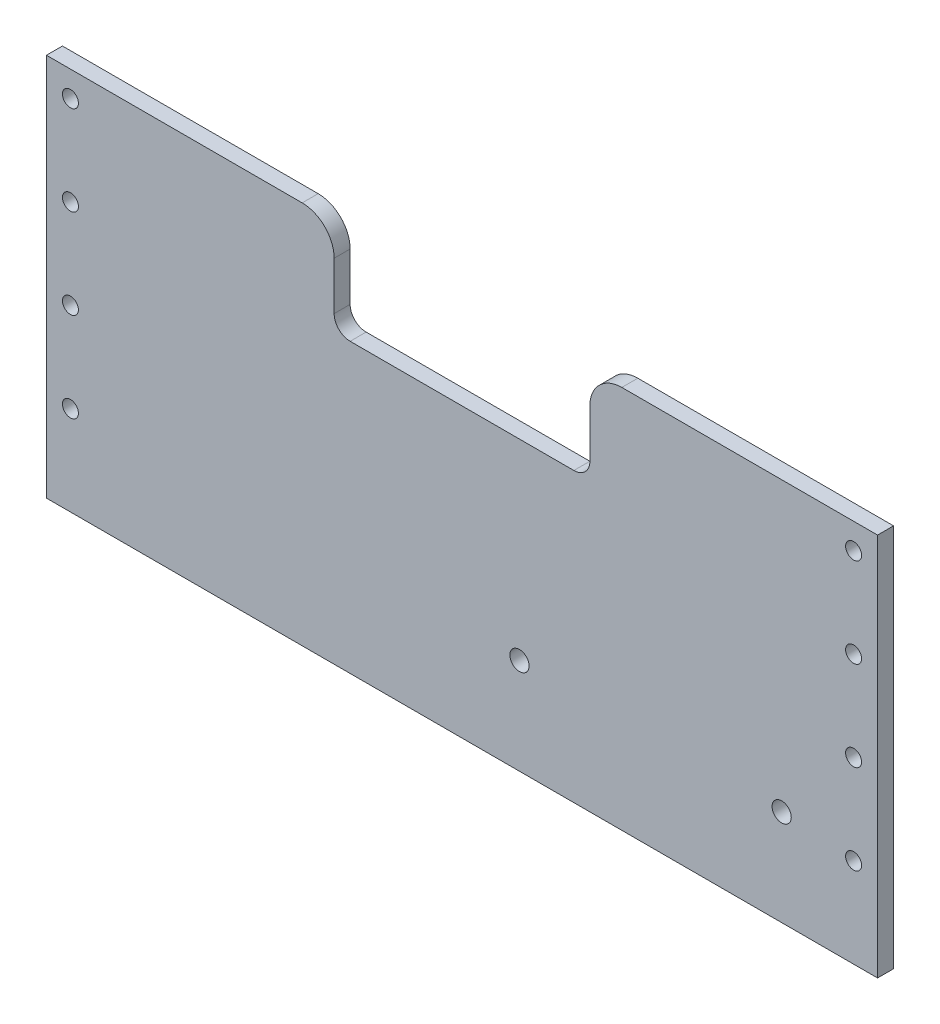
ISO-10303-21;
HEADER;
FILE_DESCRIPTION(('STEP AP214'),'2;1');
FILE_NAME('part.step','',(''),(''),'','','');
FILE_SCHEMA(('AUTOMOTIVE_DESIGN { 1 0 10303 214 1 1 1 1 }'));
ENDSEC;
DATA;
#1=APPLICATION_CONTEXT('core data for automotive mechanical design processes');
#2=APPLICATION_PROTOCOL_DEFINITION('international standard','automotive_design',2000,#1);
#3=PRODUCT_CONTEXT('',#1,'mechanical');
#4=PRODUCT('Part','Part','',(#3));
#5=PRODUCT_RELATED_PRODUCT_CATEGORY('part','',(#4));
#6=PRODUCT_DEFINITION_FORMATION('','',#4);
#7=PRODUCT_DEFINITION_CONTEXT('part definition',#1,'design');
#8=PRODUCT_DEFINITION('design','',#6,#7);
#9=PRODUCT_DEFINITION_SHAPE('','',#8);
#10=(LENGTH_UNIT() NAMED_UNIT(*) SI_UNIT(.MILLI.,.METRE.));
#11=(NAMED_UNIT(*) PLANE_ANGLE_UNIT() SI_UNIT($,.RADIAN.));
#12=(NAMED_UNIT(*) SI_UNIT($,.STERADIAN.) SOLID_ANGLE_UNIT());
#13=UNCERTAINTY_MEASURE_WITH_UNIT(LENGTH_MEASURE(1.E-05),#10,'distance_accuracy_value','');
#14=(GEOMETRIC_REPRESENTATION_CONTEXT(3) GLOBAL_UNCERTAINTY_ASSIGNED_CONTEXT((#13)) GLOBAL_UNIT_ASSIGNED_CONTEXT((#10,
#11,#12)) REPRESENTATION_CONTEXT('',''));
#15=CARTESIAN_POINT('',(0.,0.,0.));
#16=DIRECTION('',(0.,0.,1.));
#17=DIRECTION('',(1.,0.,0.));
#18=AXIS2_PLACEMENT_3D('',#15,#16,#17);
#19=CARTESIAN_POINT('',(-31.75,11.5130237147225,3.175));
#20=DIRECTION('',(0.,0.,1.));
#21=DIRECTION('',(1.,0.,0.));
#22=AXIS2_PLACEMENT_3D('',#19,#20,#21);
#23=PLANE('',#22);
#24=CARTESIAN_POINT('',(11.416585624832,-39.2869762852775,3.175));
#25=DIRECTION('',(0.,0.,1.));
#26=DIRECTION('',(1.,0.,0.));
#27=AXIS2_PLACEMENT_3D('',#24,#25,#26);
#28=CIRCLE('',#27,1.9062435416668);
#29=CARTESIAN_POINT('',(13.3228291664988,-39.2869762852775,3.175));
#30=VERTEX_POINT('',#29);
#31=EDGE_CURVE('E320',#30,#30,#28,.T.);
#32=ORIENTED_EDGE('',*,*,#31,.F.);
#33=EDGE_LOOP('',(#32));
#34=FACE_BOUND('',#33,.T.);
#35=CARTESIAN_POINT('',(77.7875,-22.7769762852775,3.175));
#36=DIRECTION('',(0.,0.,1.));
#37=DIRECTION('',(-1.,0.,0.));
#38=AXIS2_PLACEMENT_3D('',#35,#36,#37);
#39=CIRCLE('',#38,1.58749999999999);
#40=CARTESIAN_POINT('',(76.2,-22.7769762852775,3.175));
#41=VERTEX_POINT('',#40);
#42=EDGE_CURVE('E332',#41,#41,#39,.T.);
#43=ORIENTED_EDGE('',*,*,#42,.F.);
#44=EDGE_LOOP('',(#43));
#45=FACE_BOUND('',#44,.T.);
#46=CARTESIAN_POINT('',(77.7875,12.7830237147225,3.175));
#47=DIRECTION('',(0.,0.,1.));
#48=DIRECTION('',(-1.,0.,0.));
#49=AXIS2_PLACEMENT_3D('',#46,#47,#48);
#50=CIRCLE('',#49,1.58749999999999);
#51=CARTESIAN_POINT('',(76.2,12.7830237147225,3.175));
#52=VERTEX_POINT('',#51);
#53=EDGE_CURVE('E344',#52,#52,#50,.T.);
#54=ORIENTED_EDGE('',*,*,#53,.F.);
#55=EDGE_LOOP('',(#54));
#56=FACE_BOUND('',#55,.T.);
#57=CARTESIAN_POINT('',(-77.7875,-4.99697628527753,3.175));
#58=DIRECTION('',(0.,0.,1.));
#59=DIRECTION('',(1.,0.,0.));
#60=AXIS2_PLACEMENT_3D('',#57,#58,#59);
#61=CIRCLE('',#60,1.58749999999999);
#62=CARTESIAN_POINT('',(-76.2,-4.99697628527753,3.175));
#63=VERTEX_POINT('',#62);
#64=EDGE_CURVE('E356',#63,#63,#61,.T.);
#65=ORIENTED_EDGE('',*,*,#64,.F.);
#66=EDGE_LOOP('',(#65));
#67=FACE_BOUND('',#66,.T.);
#68=CARTESIAN_POINT('',(-77.7875,-40.5569762852775,3.175));
#69=DIRECTION('',(0.,0.,1.));
#70=DIRECTION('',(1.,0.,0.));
#71=AXIS2_PLACEMENT_3D('',#68,#69,#70);
#72=CIRCLE('',#71,1.58749999999999);
#73=CARTESIAN_POINT('',(-76.2,-40.5569762852775,3.175));
#74=VERTEX_POINT('',#73);
#75=EDGE_CURVE('E163',#74,#74,#72,.T.);
#76=ORIENTED_EDGE('',*,*,#75,.F.);
#77=EDGE_LOOP('',(#76));
#78=FACE_BOUND('',#77,.T.);
#79=DIRECTION('',(0.,1.,0.));
#80=VECTOR('',#79,1.);
#81=CARTESIAN_POINT('',(82.55,17.8630237147225,3.175));
#82=LINE('',#81,#80);
#83=CARTESIAN_POINT('',(82.55,-58.3369762852775,3.175));
#84=VERTEX_POINT('',#83);
#85=CARTESIAN_POINT('',(82.55,17.8630237147225,3.175));
#86=VERTEX_POINT('',#85);
#87=EDGE_CURVE('E182',#84,#86,#82,.T.);
#88=ORIENTED_EDGE('',*,*,#87,.T.);
#89=DIRECTION('',(-1.,0.,0.));
#90=VECTOR('',#89,1.);
#91=CARTESIAN_POINT('',(31.75,17.8630237147225,3.175));
#92=LINE('',#91,#90);
#93=CARTESIAN_POINT('',(31.75,17.8630237147225,3.175));
#94=VERTEX_POINT('',#93);
#95=EDGE_CURVE('E110',#86,#94,#92,.T.);
#96=ORIENTED_EDGE('',*,*,#95,.T.);
#97=CARTESIAN_POINT('',(31.75,11.5130237147225,3.175));
#98=DIRECTION('',(0.,0.,1.));
#99=DIRECTION('',(-1.,0.,0.));
#100=AXIS2_PLACEMENT_3D('',#97,#98,#99);
#101=CIRCLE('',#100,6.35);
#102=CARTESIAN_POINT('',(25.4,11.5130237147225,3.175));
#103=VERTEX_POINT('',#102);
#104=EDGE_CURVE('E209',#94,#103,#101,.T.);
#105=ORIENTED_EDGE('',*,*,#104,.T.);
#106=DIRECTION('',(0.,-1.,0.));
#107=VECTOR('',#106,1.);
#108=CARTESIAN_POINT('',(25.4,1.98802371472247,3.175));
#109=LINE('',#108,#107);
#110=CARTESIAN_POINT('',(25.4,1.98802371472247,3.175));
#111=VERTEX_POINT('',#110);
#112=EDGE_CURVE('E228',#103,#111,#109,.T.);
#113=ORIENTED_EDGE('',*,*,#112,.T.);
#114=CARTESIAN_POINT('',(22.225,1.98802371472247,3.175));
#115=DIRECTION('',(0.,0.,-1.));
#116=DIRECTION('',(-1.,0.,0.));
#117=AXIS2_PLACEMENT_3D('',#114,#115,#116);
#118=CIRCLE('',#117,3.175);
#119=CARTESIAN_POINT('',(22.225,-1.18697628527753,3.175));
#120=VERTEX_POINT('',#119);
#121=EDGE_CURVE('E225',#111,#120,#118,.T.);
#122=ORIENTED_EDGE('',*,*,#121,.T.);
#123=DIRECTION('',(-1.,0.,0.));
#124=VECTOR('',#123,1.);
#125=CARTESIAN_POINT('',(-22.225,-1.18697628527753,3.175));
#126=LINE('',#125,#124);
#127=CARTESIAN_POINT('',(-22.225,-1.18697628527753,3.175));
#128=VERTEX_POINT('',#127);
#129=EDGE_CURVE('E227',#120,#128,#126,.T.);
#130=ORIENTED_EDGE('',*,*,#129,.T.);
#131=CARTESIAN_POINT('',(-22.225,1.98802371472247,3.175));
#132=DIRECTION('',(0.,0.,-1.));
#133=DIRECTION('',(1.,0.,0.));
#134=AXIS2_PLACEMENT_3D('',#131,#132,#133);
#135=CIRCLE('',#134,3.175);
#136=CARTESIAN_POINT('',(-25.4,1.98802371472247,3.175));
#137=VERTEX_POINT('',#136);
#138=EDGE_CURVE('E230',#128,#137,#135,.T.);
#139=ORIENTED_EDGE('',*,*,#138,.T.);
#140=DIRECTION('',(0.,1.,0.));
#141=VECTOR('',#140,1.);
#142=CARTESIAN_POINT('',(-25.4,1.98802371472247,3.175));
#143=LINE('',#142,#141);
#144=CARTESIAN_POINT('',(-25.4,11.5130237147225,3.175));
#145=VERTEX_POINT('',#144);
#146=EDGE_CURVE('E236',#137,#145,#143,.T.);
#147=ORIENTED_EDGE('',*,*,#146,.T.);
#148=CARTESIAN_POINT('',(-31.75,11.5130237147225,3.175));
#149=DIRECTION('',(0.,0.,1.));
#150=DIRECTION('',(1.,0.,0.));
#151=AXIS2_PLACEMENT_3D('',#148,#149,#150);
#152=CIRCLE('',#151,6.35);
#153=CARTESIAN_POINT('',(-31.75,17.8630237147225,3.175));
#154=VERTEX_POINT('',#153);
#155=EDGE_CURVE('E141',#145,#154,#152,.T.);
#156=ORIENTED_EDGE('',*,*,#155,.T.);
#157=DIRECTION('',(-1.,0.,0.));
#158=VECTOR('',#157,1.);
#159=CARTESIAN_POINT('',(-82.55,17.8630237147225,3.175));
#160=LINE('',#159,#158);
#161=CARTESIAN_POINT('',(-82.55,17.8630237147225,3.175));
#162=VERTEX_POINT('',#161);
#163=EDGE_CURVE('E135',#154,#162,#160,.T.);
#164=ORIENTED_EDGE('',*,*,#163,.T.);
#165=DIRECTION('',(0.,-1.,0.));
#166=VECTOR('',#165,1.);
#167=CARTESIAN_POINT('',(-82.55,17.8630237147225,3.175));
#168=LINE('',#167,#166);
#169=CARTESIAN_POINT('',(-82.55,-58.3369762852775,3.175));
#170=VERTEX_POINT('',#169);
#171=EDGE_CURVE('E139',#162,#170,#168,.T.);
#172=ORIENTED_EDGE('',*,*,#171,.T.);
#173=DIRECTION('',(1.,0.,0.));
#174=VECTOR('',#173,1.);
#175=CARTESIAN_POINT('',(-82.55,-58.3369762852775,3.175));
#176=LINE('',#175,#174);
#177=EDGE_CURVE('E55',#170,#84,#176,.T.);
#178=ORIENTED_EDGE('',*,*,#177,.T.);
#179=EDGE_LOOP('',(#88,#96,#105,#113,#122,#130,#139,#147,#156,#164,#172,#178));
#180=FACE_BOUND('',#179,.T.);
#181=CARTESIAN_POINT('',(-77.7875,-22.7769762852775,3.175));
#182=DIRECTION('',(0.,0.,1.));
#183=DIRECTION('',(1.,0.,0.));
#184=AXIS2_PLACEMENT_3D('',#181,#182,#183);
#185=CIRCLE('',#184,1.58749999999999);
#186=CARTESIAN_POINT('',(-76.2,-22.7769762852775,3.175));
#187=VERTEX_POINT('',#186);
#188=EDGE_CURVE('E362',#187,#187,#185,.T.);
#189=ORIENTED_EDGE('',*,*,#188,.F.);
#190=EDGE_LOOP('',(#189));
#191=FACE_BOUND('',#190,.T.);
#192=CARTESIAN_POINT('',(-77.7875,12.7830237147225,3.175));
#193=DIRECTION('',(0.,0.,1.));
#194=DIRECTION('',(1.,0.,0.));
#195=AXIS2_PLACEMENT_3D('',#192,#193,#194);
#196=CIRCLE('',#195,1.58749999999999);
#197=CARTESIAN_POINT('',(-76.2,12.7830237147225,3.175));
#198=VERTEX_POINT('',#197);
#199=EDGE_CURVE('E350',#198,#198,#196,.T.);
#200=ORIENTED_EDGE('',*,*,#199,.F.);
#201=EDGE_LOOP('',(#200));
#202=FACE_BOUND('',#201,.T.);
#203=CARTESIAN_POINT('',(77.7875,-4.99697628527753,3.175));
#204=DIRECTION('',(0.,0.,1.));
#205=DIRECTION('',(-1.,0.,0.));
#206=AXIS2_PLACEMENT_3D('',#203,#204,#205);
#207=CIRCLE('',#206,1.58749999999999);
#208=CARTESIAN_POINT('',(76.2,-4.99697628527753,3.175));
#209=VERTEX_POINT('',#208);
#210=EDGE_CURVE('E338',#209,#209,#207,.T.);
#211=ORIENTED_EDGE('',*,*,#210,.F.);
#212=EDGE_LOOP('',(#211));
#213=FACE_BOUND('',#212,.T.);
#214=CARTESIAN_POINT('',(77.7875,-40.5569762852775,3.175));
#215=DIRECTION('',(0.,0.,1.));
#216=DIRECTION('',(-1.,0.,0.));
#217=AXIS2_PLACEMENT_3D('',#214,#215,#216);
#218=CIRCLE('',#217,1.58749999999999);
#219=CARTESIAN_POINT('',(76.2,-40.5569762852775,3.175));
#220=VERTEX_POINT('',#219);
#221=EDGE_CURVE('E326',#220,#220,#218,.T.);
#222=ORIENTED_EDGE('',*,*,#221,.F.);
#223=EDGE_LOOP('',(#222));
#224=FACE_BOUND('',#223,.T.);
#225=CARTESIAN_POINT('',(63.5,-39.2869762852775,3.175));
#226=DIRECTION('',(0.,0.,1.));
#227=DIRECTION('',(1.,0.,0.));
#228=AXIS2_PLACEMENT_3D('',#225,#226,#227);
#229=CIRCLE('',#228,1.90624354166674);
#230=CARTESIAN_POINT('',(65.4062435416668,-39.2869762852775,3.175));
#231=VERTEX_POINT('',#230);
#232=EDGE_CURVE('E311',#231,#231,#229,.T.);
#233=ORIENTED_EDGE('',*,*,#232,.F.);
#234=EDGE_LOOP('',(#233));
#235=FACE_BOUND('',#234,.T.);
#236=ADVANCED_FACE('F38',(#34,#45,#56,#67,#78,#180,#191,#202,#213,#224,#235),#23,.T.);
#237=CARTESIAN_POINT('',(-31.75,11.5130237147225,0.));
#238=DIRECTION('',(0.,0.,1.));
#239=DIRECTION('',(1.,0.,0.));
#240=AXIS2_PLACEMENT_3D('',#237,#238,#239);
#241=PLANE('',#240);
#242=DIRECTION('',(0.,1.,0.));
#243=VECTOR('',#242,1.);
#244=CARTESIAN_POINT('',(82.55,17.8630237147225,0.));
#245=LINE('',#244,#243);
#246=CARTESIAN_POINT('',(82.55,-58.3369762852775,0.));
#247=VERTEX_POINT('',#246);
#248=CARTESIAN_POINT('',(82.55,17.8630237147225,0.));
#249=VERTEX_POINT('',#248);
#250=EDGE_CURVE('E159',#247,#249,#245,.T.);
#251=ORIENTED_EDGE('',*,*,#250,.F.);
#252=DIRECTION('',(1.,0.,0.));
#253=VECTOR('',#252,1.);
#254=CARTESIAN_POINT('',(-82.55,-58.3369762852775,0.));
#255=LINE('',#254,#253);
#256=CARTESIAN_POINT('',(-82.55,-58.3369762852775,0.));
#257=VERTEX_POINT('',#256);
#258=EDGE_CURVE('E102',#257,#247,#255,.T.);
#259=ORIENTED_EDGE('',*,*,#258,.F.);
#260=DIRECTION('',(0.,-1.,0.));
#261=VECTOR('',#260,1.);
#262=CARTESIAN_POINT('',(-82.55,17.8630237147225,0.));
#263=LINE('',#262,#261);
#264=CARTESIAN_POINT('',(-82.55,17.8630237147225,0.));
#265=VERTEX_POINT('',#264);
#266=EDGE_CURVE('E96',#265,#257,#263,.T.);
#267=ORIENTED_EDGE('',*,*,#266,.F.);
#268=DIRECTION('',(-1.,0.,0.));
#269=VECTOR('',#268,1.);
#270=CARTESIAN_POINT('',(-82.55,17.8630237147225,0.));
#271=LINE('',#270,#269);
#272=CARTESIAN_POINT('',(-31.75,17.8630237147225,0.));
#273=VERTEX_POINT('',#272);
#274=EDGE_CURVE('E149',#273,#265,#271,.T.);
#275=ORIENTED_EDGE('',*,*,#274,.F.);
#276=CARTESIAN_POINT('',(-31.75,11.5130237147225,0.));
#277=DIRECTION('',(0.,0.,1.));
#278=DIRECTION('',(1.,0.,0.));
#279=AXIS2_PLACEMENT_3D('',#276,#277,#278);
#280=CIRCLE('',#279,6.35);
#281=CARTESIAN_POINT('',(-25.4,11.5130237147225,0.));
#282=VERTEX_POINT('',#281);
#283=EDGE_CURVE('E177',#282,#273,#280,.T.);
#284=ORIENTED_EDGE('',*,*,#283,.F.);
#285=DIRECTION('',(0.,1.,0.));
#286=VECTOR('',#285,1.);
#287=CARTESIAN_POINT('',(-25.4,1.98802371472247,0.));
#288=LINE('',#287,#286);
#289=CARTESIAN_POINT('',(-25.4,1.98802371472247,0.));
#290=VERTEX_POINT('',#289);
#291=EDGE_CURVE('E175',#290,#282,#288,.T.);
#292=ORIENTED_EDGE('',*,*,#291,.F.);
#293=CARTESIAN_POINT('',(-22.225,1.98802371472247,0.));
#294=DIRECTION('',(0.,0.,-1.));
#295=DIRECTION('',(1.,0.,0.));
#296=AXIS2_PLACEMENT_3D('',#293,#294,#295);
#297=CIRCLE('',#296,3.175);
#298=CARTESIAN_POINT('',(-22.225,-1.18697628527753,0.));
#299=VERTEX_POINT('',#298);
#300=EDGE_CURVE('E173',#299,#290,#297,.T.);
#301=ORIENTED_EDGE('',*,*,#300,.F.);
#302=DIRECTION('',(-1.,0.,0.));
#303=VECTOR('',#302,1.);
#304=CARTESIAN_POINT('',(-22.225,-1.18697628527753,0.));
#305=LINE('',#304,#303);
#306=CARTESIAN_POINT('',(22.225,-1.18697628527753,0.));
#307=VERTEX_POINT('',#306);
#308=EDGE_CURVE('E171',#307,#299,#305,.T.);
#309=ORIENTED_EDGE('',*,*,#308,.F.);
#310=CARTESIAN_POINT('',(22.225,1.98802371472247,0.));
#311=DIRECTION('',(0.,0.,-1.));
#312=DIRECTION('',(-1.,0.,0.));
#313=AXIS2_PLACEMENT_3D('',#310,#311,#312);
#314=CIRCLE('',#313,3.175);
#315=CARTESIAN_POINT('',(25.4,1.98802371472247,0.));
#316=VERTEX_POINT('',#315);
#317=EDGE_CURVE('E169',#316,#307,#314,.T.);
#318=ORIENTED_EDGE('',*,*,#317,.F.);
#319=DIRECTION('',(0.,-1.,0.));
#320=VECTOR('',#319,1.);
#321=CARTESIAN_POINT('',(25.4,1.98802371472247,0.));
#322=LINE('',#321,#320);
#323=CARTESIAN_POINT('',(25.4,11.5130237147225,0.));
#324=VERTEX_POINT('',#323);
#325=EDGE_CURVE('E167',#324,#316,#322,.T.);
#326=ORIENTED_EDGE('',*,*,#325,.F.);
#327=CARTESIAN_POINT('',(31.75,11.5130237147225,0.));
#328=DIRECTION('',(0.,0.,1.));
#329=DIRECTION('',(-1.,0.,0.));
#330=AXIS2_PLACEMENT_3D('',#327,#328,#329);
#331=CIRCLE('',#330,6.35);
#332=CARTESIAN_POINT('',(31.75,17.8630237147225,0.));
#333=VERTEX_POINT('',#332);
#334=EDGE_CURVE('E165',#333,#324,#331,.T.);
#335=ORIENTED_EDGE('',*,*,#334,.F.);
#336=DIRECTION('',(-1.,0.,0.));
#337=VECTOR('',#336,1.);
#338=CARTESIAN_POINT('',(31.75,17.8630237147225,0.));
#339=LINE('',#338,#337);
#340=EDGE_CURVE('E162',#249,#333,#339,.T.);
#341=ORIENTED_EDGE('',*,*,#340,.F.);
#342=EDGE_LOOP('',(#251,#259,#267,#275,#284,#292,#301,#309,#318,#326,#335,#341));
#343=FACE_BOUND('',#342,.T.);
#344=CARTESIAN_POINT('',(-77.7875,-40.5569762852775,0.));
#345=DIRECTION('',(0.,0.,1.));
#346=DIRECTION('',(1.,0.,0.));
#347=AXIS2_PLACEMENT_3D('',#344,#345,#346);
#348=CIRCLE('',#347,1.58749999999999);
#349=CARTESIAN_POINT('',(-76.2,-40.5569762852775,0.));
#350=VERTEX_POINT('',#349);
#351=EDGE_CURVE('E365',#350,#350,#348,.T.);
#352=ORIENTED_EDGE('',*,*,#351,.T.);
#353=EDGE_LOOP('',(#352));
#354=FACE_BOUND('',#353,.T.);
#355=CARTESIAN_POINT('',(-77.7875,-22.7769762852775,0.));
#356=DIRECTION('',(0.,0.,1.));
#357=DIRECTION('',(1.,0.,0.));
#358=AXIS2_PLACEMENT_3D('',#355,#356,#357);
#359=CIRCLE('',#358,1.58749999999999);
#360=CARTESIAN_POINT('',(-76.2,-22.7769762852775,0.));
#361=VERTEX_POINT('',#360);
#362=EDGE_CURVE('E359',#361,#361,#359,.T.);
#363=ORIENTED_EDGE('',*,*,#362,.T.);
#364=EDGE_LOOP('',(#363));
#365=FACE_BOUND('',#364,.T.);
#366=CARTESIAN_POINT('',(-77.7875,-4.99697628527753,0.));
#367=DIRECTION('',(0.,0.,1.));
#368=DIRECTION('',(1.,0.,0.));
#369=AXIS2_PLACEMENT_3D('',#366,#367,#368);
#370=CIRCLE('',#369,1.58749999999999);
#371=CARTESIAN_POINT('',(-76.2,-4.99697628527753,0.));
#372=VERTEX_POINT('',#371);
#373=EDGE_CURVE('E353',#372,#372,#370,.T.);
#374=ORIENTED_EDGE('',*,*,#373,.T.);
#375=EDGE_LOOP('',(#374));
#376=FACE_BOUND('',#375,.T.);
#377=CARTESIAN_POINT('',(-77.7875,12.7830237147225,0.));
#378=DIRECTION('',(0.,0.,1.));
#379=DIRECTION('',(1.,0.,0.));
#380=AXIS2_PLACEMENT_3D('',#377,#378,#379);
#381=CIRCLE('',#380,1.58749999999999);
#382=CARTESIAN_POINT('',(-76.2,12.7830237147225,0.));
#383=VERTEX_POINT('',#382);
#384=EDGE_CURVE('E347',#383,#383,#381,.T.);
#385=ORIENTED_EDGE('',*,*,#384,.T.);
#386=EDGE_LOOP('',(#385));
#387=FACE_BOUND('',#386,.T.);
#388=CARTESIAN_POINT('',(77.7875,12.7830237147225,0.));
#389=DIRECTION('',(0.,0.,1.));
#390=DIRECTION('',(-1.,0.,0.));
#391=AXIS2_PLACEMENT_3D('',#388,#389,#390);
#392=CIRCLE('',#391,1.58749999999999);
#393=CARTESIAN_POINT('',(76.2,12.7830237147225,0.));
#394=VERTEX_POINT('',#393);
#395=EDGE_CURVE('E341',#394,#394,#392,.T.);
#396=ORIENTED_EDGE('',*,*,#395,.T.);
#397=EDGE_LOOP('',(#396));
#398=FACE_BOUND('',#397,.T.);
#399=CARTESIAN_POINT('',(77.7875,-4.99697628527753,0.));
#400=DIRECTION('',(0.,0.,1.));
#401=DIRECTION('',(-1.,0.,0.));
#402=AXIS2_PLACEMENT_3D('',#399,#400,#401);
#403=CIRCLE('',#402,1.58749999999999);
#404=CARTESIAN_POINT('',(76.2,-4.99697628527753,0.));
#405=VERTEX_POINT('',#404);
#406=EDGE_CURVE('E335',#405,#405,#403,.T.);
#407=ORIENTED_EDGE('',*,*,#406,.T.);
#408=EDGE_LOOP('',(#407));
#409=FACE_BOUND('',#408,.T.);
#410=CARTESIAN_POINT('',(77.7875,-22.7769762852775,0.));
#411=DIRECTION('',(0.,0.,1.));
#412=DIRECTION('',(-1.,0.,0.));
#413=AXIS2_PLACEMENT_3D('',#410,#411,#412);
#414=CIRCLE('',#413,1.58749999999999);
#415=CARTESIAN_POINT('',(76.2,-22.7769762852775,0.));
#416=VERTEX_POINT('',#415);
#417=EDGE_CURVE('E329',#416,#416,#414,.T.);
#418=ORIENTED_EDGE('',*,*,#417,.T.);
#419=EDGE_LOOP('',(#418));
#420=FACE_BOUND('',#419,.T.);
#421=CARTESIAN_POINT('',(77.7875,-40.5569762852775,0.));
#422=DIRECTION('',(0.,0.,1.));
#423=DIRECTION('',(-1.,0.,0.));
#424=AXIS2_PLACEMENT_3D('',#421,#422,#423);
#425=CIRCLE('',#424,1.58749999999999);
#426=CARTESIAN_POINT('',(76.2,-40.5569762852775,0.));
#427=VERTEX_POINT('',#426);
#428=EDGE_CURVE('E323',#427,#427,#425,.T.);
#429=ORIENTED_EDGE('',*,*,#428,.T.);
#430=EDGE_LOOP('',(#429));
#431=FACE_BOUND('',#430,.T.);
#432=CARTESIAN_POINT('',(11.416585624832,-39.2869762852775,0.));
#433=DIRECTION('',(0.,0.,1.));
#434=DIRECTION('',(1.,0.,0.));
#435=AXIS2_PLACEMENT_3D('',#432,#433,#434);
#436=CIRCLE('',#435,1.9062435416668);
#437=CARTESIAN_POINT('',(13.3228291664988,-39.2869762852775,0.));
#438=VERTEX_POINT('',#437);
#439=EDGE_CURVE('E317',#438,#438,#436,.T.);
#440=ORIENTED_EDGE('',*,*,#439,.T.);
#441=EDGE_LOOP('',(#440));
#442=FACE_BOUND('',#441,.T.);
#443=CARTESIAN_POINT('',(63.5,-39.2869762852775,0.));
#444=DIRECTION('',(0.,0.,1.));
#445=DIRECTION('',(1.,0.,0.));
#446=AXIS2_PLACEMENT_3D('',#443,#444,#445);
#447=CIRCLE('',#446,1.90624354166674);
#448=CARTESIAN_POINT('',(65.4062435416668,-39.2869762852775,0.));
#449=VERTEX_POINT('',#448);
#450=EDGE_CURVE('E314',#449,#449,#447,.T.);
#451=ORIENTED_EDGE('',*,*,#450,.T.);
#452=EDGE_LOOP('',(#451));
#453=FACE_BOUND('',#452,.T.);
#454=ADVANCED_FACE('F213',(#343,#354,#365,#376,#387,#398,#409,#420,#431,#442,#453),#241,.F.);
#455=CARTESIAN_POINT('',(82.55,17.8630237147225,3.175));
#456=DIRECTION('',(-1.,0.,0.));
#457=DIRECTION('',(0.,0.,1.));
#458=AXIS2_PLACEMENT_3D('',#455,#456,#457);
#459=PLANE('',#458);
#460=ORIENTED_EDGE('',*,*,#250,.T.);
#461=DIRECTION('',(0.,0.,-1.));
#462=VECTOR('',#461,1.);
#463=CARTESIAN_POINT('',(82.55,17.8630237147225,3.175));
#464=LINE('',#463,#462);
#465=EDGE_CURVE('E11',#86,#249,#464,.T.);
#466=ORIENTED_EDGE('',*,*,#465,.F.);
#467=ORIENTED_EDGE('',*,*,#87,.F.);
#468=DIRECTION('',(0.,0.,-1.));
#469=VECTOR('',#468,1.);
#470=CARTESIAN_POINT('',(82.55,-58.3369762852775,3.175));
#471=LINE('',#470,#469);
#472=EDGE_CURVE('E155',#84,#247,#471,.T.);
#473=ORIENTED_EDGE('',*,*,#472,.T.);
#474=EDGE_LOOP('',(#460,#466,#467,#473));
#475=FACE_BOUND('',#474,.T.);
#476=ADVANCED_FACE('F40',(#475),#459,.F.);
#477=CARTESIAN_POINT('',(31.75,17.8630237147225,3.175));
#478=DIRECTION('',(0.,-1.,0.));
#479=DIRECTION('',(0.,0.,-1.));
#480=AXIS2_PLACEMENT_3D('',#477,#478,#479);
#481=PLANE('',#480);
#482=ORIENTED_EDGE('',*,*,#340,.T.);
#483=DIRECTION('',(0.,0.,-1.));
#484=VECTOR('',#483,1.);
#485=CARTESIAN_POINT('',(31.75,17.8630237147225,3.175));
#486=LINE('',#485,#484);
#487=EDGE_CURVE('E47',#94,#333,#486,.T.);
#488=ORIENTED_EDGE('',*,*,#487,.F.);
#489=ORIENTED_EDGE('',*,*,#95,.F.);
#490=ORIENTED_EDGE('',*,*,#465,.T.);
#491=EDGE_LOOP('',(#482,#488,#489,#490));
#492=FACE_BOUND('',#491,.T.);
#493=ADVANCED_FACE('F539',(#492),#481,.F.);
#494=CARTESIAN_POINT('',(31.75,11.5130237147225,3.175));
#495=DIRECTION('',(0.,0.,-1.));
#496=DIRECTION('',(-1.,0.,0.));
#497=AXIS2_PLACEMENT_3D('',#494,#495,#496);
#498=CYLINDRICAL_SURFACE('',#497,6.35);
#499=ORIENTED_EDGE('',*,*,#334,.T.);
#500=DIRECTION('',(0.,0.,-1.));
#501=VECTOR('',#500,1.);
#502=CARTESIAN_POINT('',(25.4,11.5130237147225,3.175));
#503=LINE('',#502,#501);
#504=EDGE_CURVE('E201',#103,#324,#503,.T.);
#505=ORIENTED_EDGE('',*,*,#504,.F.);
#506=ORIENTED_EDGE('',*,*,#104,.F.);
#507=ORIENTED_EDGE('',*,*,#487,.T.);
#508=EDGE_LOOP('',(#499,#505,#506,#507));
#509=FACE_BOUND('',#508,.T.);
#510=ADVANCED_FACE('F207',(#509),#498,.T.);
#511=CARTESIAN_POINT('',(25.4,1.98802371472247,3.175));
#512=DIRECTION('',(1.,0.,0.));
#513=DIRECTION('',(0.,0.,-1.));
#514=AXIS2_PLACEMENT_3D('',#511,#512,#513);
#515=PLANE('',#514);
#516=ORIENTED_EDGE('',*,*,#325,.T.);
#517=DIRECTION('',(0.,0.,-1.));
#518=VECTOR('',#517,1.);
#519=CARTESIAN_POINT('',(25.4,1.98802371472247,3.175));
#520=LINE('',#519,#518);
#521=EDGE_CURVE('E198',#111,#316,#520,.T.);
#522=ORIENTED_EDGE('',*,*,#521,.F.);
#523=ORIENTED_EDGE('',*,*,#112,.F.);
#524=ORIENTED_EDGE('',*,*,#504,.T.);
#525=EDGE_LOOP('',(#516,#522,#523,#524));
#526=FACE_BOUND('',#525,.T.);
#527=ADVANCED_FACE('F219',(#526),#515,.F.);
#528=CARTESIAN_POINT('',(22.225,1.98802371472247,3.175));
#529=DIRECTION('',(0.,0.,-1.));
#530=DIRECTION('',(-1.,0.,0.));
#531=AXIS2_PLACEMENT_3D('',#528,#529,#530);
#532=CYLINDRICAL_SURFACE('',#531,3.175);
#533=ORIENTED_EDGE('',*,*,#317,.T.);
#534=DIRECTION('',(0.,0.,-1.));
#535=VECTOR('',#534,1.);
#536=CARTESIAN_POINT('',(22.225,-1.18697628527753,3.175));
#537=LINE('',#536,#535);
#538=EDGE_CURVE('E195',#120,#307,#537,.T.);
#539=ORIENTED_EDGE('',*,*,#538,.F.);
#540=ORIENTED_EDGE('',*,*,#121,.F.);
#541=ORIENTED_EDGE('',*,*,#521,.T.);
#542=EDGE_LOOP('',(#533,#539,#540,#541));
#543=FACE_BOUND('',#542,.T.);
#544=ADVANCED_FACE('F223',(#543),#532,.F.);
#545=CARTESIAN_POINT('',(-22.225,-1.18697628527753,3.175));
#546=DIRECTION('',(0.,-1.,0.));
#547=DIRECTION('',(1.,0.,0.));
#548=AXIS2_PLACEMENT_3D('',#545,#546,#547);
#549=PLANE('',#548);
#550=ORIENTED_EDGE('',*,*,#308,.T.);
#551=DIRECTION('',(0.,0.,-1.));
#552=VECTOR('',#551,1.);
#553=CARTESIAN_POINT('',(-22.225,-1.18697628527753,3.175));
#554=LINE('',#553,#552);
#555=EDGE_CURVE('E192',#128,#299,#554,.T.);
#556=ORIENTED_EDGE('',*,*,#555,.F.);
#557=ORIENTED_EDGE('',*,*,#129,.F.);
#558=ORIENTED_EDGE('',*,*,#538,.T.);
#559=EDGE_LOOP('',(#550,#556,#557,#558));
#560=FACE_BOUND('',#559,.T.);
#561=ADVANCED_FACE('F504',(#560),#549,.F.);
#562=CARTESIAN_POINT('',(-22.225,1.98802371472247,3.175));
#563=DIRECTION('',(0.,0.,-1.));
#564=DIRECTION('',(-1.,0.,0.));
#565=AXIS2_PLACEMENT_3D('',#562,#563,#564);
#566=CYLINDRICAL_SURFACE('',#565,3.175);
#567=ORIENTED_EDGE('',*,*,#300,.T.);
#568=DIRECTION('',(0.,0.,-1.));
#569=VECTOR('',#568,1.);
#570=CARTESIAN_POINT('',(-25.4,1.98802371472247,3.175));
#571=LINE('',#570,#569);
#572=EDGE_CURVE('E189',#137,#290,#571,.T.);
#573=ORIENTED_EDGE('',*,*,#572,.F.);
#574=ORIENTED_EDGE('',*,*,#138,.F.);
#575=ORIENTED_EDGE('',*,*,#555,.T.);
#576=EDGE_LOOP('',(#567,#573,#574,#575));
#577=FACE_BOUND('',#576,.T.);
#578=ADVANCED_FACE('F495',(#577),#566,.F.);
#579=CARTESIAN_POINT('',(-25.4,1.98802371472247,3.175));
#580=DIRECTION('',(-1.,0.,0.));
#581=DIRECTION('',(0.,0.,1.));
#582=AXIS2_PLACEMENT_3D('',#579,#580,#581);
#583=PLANE('',#582);
#584=ORIENTED_EDGE('',*,*,#291,.T.);
#585=DIRECTION('',(0.,0.,-1.));
#586=VECTOR('',#585,1.);
#587=CARTESIAN_POINT('',(-25.4,11.5130237147225,3.175));
#588=LINE('',#587,#586);
#589=EDGE_CURVE('E186',#145,#282,#588,.T.);
#590=ORIENTED_EDGE('',*,*,#589,.F.);
#591=ORIENTED_EDGE('',*,*,#146,.F.);
#592=ORIENTED_EDGE('',*,*,#572,.T.);
#593=EDGE_LOOP('',(#584,#590,#591,#592));
#594=FACE_BOUND('',#593,.T.);
#595=ADVANCED_FACE('F242',(#594),#583,.F.);
#596=CARTESIAN_POINT('',(-31.75,11.5130237147225,3.175));
#597=DIRECTION('',(0.,0.,-1.));
#598=DIRECTION('',(-1.,0.,0.));
#599=AXIS2_PLACEMENT_3D('',#596,#597,#598);
#600=CYLINDRICAL_SURFACE('',#599,6.35);
#601=ORIENTED_EDGE('',*,*,#283,.T.);
#602=DIRECTION('',(0.,0.,-1.));
#603=VECTOR('',#602,1.);
#604=CARTESIAN_POINT('',(-31.75,17.8630237147225,3.175));
#605=LINE('',#604,#603);
#606=EDGE_CURVE('E150',#154,#273,#605,.T.);
#607=ORIENTED_EDGE('',*,*,#606,.F.);
#608=ORIENTED_EDGE('',*,*,#155,.F.);
#609=ORIENTED_EDGE('',*,*,#589,.T.);
#610=EDGE_LOOP('',(#601,#607,#608,#609));
#611=FACE_BOUND('',#610,.T.);
#612=ADVANCED_FACE('F246',(#611),#600,.T.);
#613=CARTESIAN_POINT('',(-82.55,17.8630237147225,3.175));
#614=DIRECTION('',(0.,-1.,0.));
#615=DIRECTION('',(1.,0.,0.));
#616=AXIS2_PLACEMENT_3D('',#613,#614,#615);
#617=PLANE('',#616);
#618=ORIENTED_EDGE('',*,*,#274,.T.);
#619=DIRECTION('',(0.,0.,-1.));
#620=VECTOR('',#619,1.);
#621=CARTESIAN_POINT('',(-82.55,17.8630237147225,3.175));
#622=LINE('',#621,#620);
#623=EDGE_CURVE('E146',#162,#265,#622,.T.);
#624=ORIENTED_EDGE('',*,*,#623,.F.);
#625=ORIENTED_EDGE('',*,*,#163,.F.);
#626=ORIENTED_EDGE('',*,*,#606,.T.);
#627=EDGE_LOOP('',(#618,#624,#625,#626));
#628=FACE_BOUND('',#627,.T.);
#629=ADVANCED_FACE('F147',(#628),#617,.F.);
#630=CARTESIAN_POINT('',(-82.55,17.8630237147225,3.175));
#631=DIRECTION('',(1.,0.,0.));
#632=DIRECTION('',(0.,0.,-1.));
#633=AXIS2_PLACEMENT_3D('',#630,#631,#632);
#634=PLANE('',#633);
#635=ORIENTED_EDGE('',*,*,#266,.T.);
#636=DIRECTION('',(0.,0.,-1.));
#637=VECTOR('',#636,1.);
#638=CARTESIAN_POINT('',(-82.55,-58.3369762852775,3.175));
#639=LINE('',#638,#637);
#640=EDGE_CURVE('E151',#170,#257,#639,.T.);
#641=ORIENTED_EDGE('',*,*,#640,.F.);
#642=ORIENTED_EDGE('',*,*,#171,.F.);
#643=ORIENTED_EDGE('',*,*,#623,.T.);
#644=EDGE_LOOP('',(#635,#641,#642,#643));
#645=FACE_BOUND('',#644,.T.);
#646=ADVANCED_FACE('F153',(#645),#634,.F.);
#647=CARTESIAN_POINT('',(-82.55,-58.3369762852775,3.175));
#648=DIRECTION('',(0.,1.,0.));
#649=DIRECTION('',(0.,0.,1.));
#650=AXIS2_PLACEMENT_3D('',#647,#648,#649);
#651=PLANE('',#650);
#652=ORIENTED_EDGE('',*,*,#258,.T.);
#653=ORIENTED_EDGE('',*,*,#472,.F.);
#654=ORIENTED_EDGE('',*,*,#177,.F.);
#655=ORIENTED_EDGE('',*,*,#640,.T.);
#656=EDGE_LOOP('',(#652,#653,#654,#655));
#657=FACE_BOUND('',#656,.T.);
#658=ADVANCED_FACE('F250',(#657),#651,.F.);
#659=CARTESIAN_POINT('',(-77.7875,-40.5569762852775,3.175));
#660=DIRECTION('',(0.,0.,-1.));
#661=DIRECTION('',(-1.,0.,0.));
#662=AXIS2_PLACEMENT_3D('',#659,#660,#661);
#663=CYLINDRICAL_SURFACE('',#662,1.58749999999999);
#664=ORIENTED_EDGE('',*,*,#75,.T.);
#665=EDGE_LOOP('',(#664));
#666=FACE_BOUND('',#665,.T.);
#667=ORIENTED_EDGE('',*,*,#351,.F.);
#668=EDGE_LOOP('',(#667));
#669=FACE_BOUND('',#668,.T.);
#670=ADVANCED_FACE('F252',(#666,#669),#663,.F.);
#671=CARTESIAN_POINT('',(-77.7875,-22.7769762852775,3.175));
#672=DIRECTION('',(0.,0.,-1.));
#673=DIRECTION('',(-1.,0.,0.));
#674=AXIS2_PLACEMENT_3D('',#671,#672,#673);
#675=CYLINDRICAL_SURFACE('',#674,1.58749999999999);
#676=ORIENTED_EDGE('',*,*,#188,.T.);
#677=EDGE_LOOP('',(#676));
#678=FACE_BOUND('',#677,.T.);
#679=ORIENTED_EDGE('',*,*,#362,.F.);
#680=EDGE_LOOP('',(#679));
#681=FACE_BOUND('',#680,.T.);
#682=ADVANCED_FACE('F258',(#678,#681),#675,.F.);
#683=CARTESIAN_POINT('',(-77.7875,-4.99697628527753,3.175));
#684=DIRECTION('',(0.,0.,-1.));
#685=DIRECTION('',(-1.,0.,0.));
#686=AXIS2_PLACEMENT_3D('',#683,#684,#685);
#687=CYLINDRICAL_SURFACE('',#686,1.58749999999999);
#688=ORIENTED_EDGE('',*,*,#64,.T.);
#689=EDGE_LOOP('',(#688));
#690=FACE_BOUND('',#689,.T.);
#691=ORIENTED_EDGE('',*,*,#373,.F.);
#692=EDGE_LOOP('',(#691));
#693=FACE_BOUND('',#692,.T.);
#694=ADVANCED_FACE('F274',(#690,#693),#687,.F.);
#695=CARTESIAN_POINT('',(-77.7875,12.7830237147225,3.175));
#696=DIRECTION('',(0.,0.,-1.));
#697=DIRECTION('',(-1.,0.,0.));
#698=AXIS2_PLACEMENT_3D('',#695,#696,#697);
#699=CYLINDRICAL_SURFACE('',#698,1.58749999999999);
#700=ORIENTED_EDGE('',*,*,#199,.T.);
#701=EDGE_LOOP('',(#700));
#702=FACE_BOUND('',#701,.T.);
#703=ORIENTED_EDGE('',*,*,#384,.F.);
#704=EDGE_LOOP('',(#703));
#705=FACE_BOUND('',#704,.T.);
#706=ADVANCED_FACE('F278',(#702,#705),#699,.F.);
#707=CARTESIAN_POINT('',(77.7875,12.7830237147225,3.175));
#708=DIRECTION('',(0.,0.,-1.));
#709=DIRECTION('',(-1.,0.,0.));
#710=AXIS2_PLACEMENT_3D('',#707,#708,#709);
#711=CYLINDRICAL_SURFACE('',#710,1.58749999999999);
#712=ORIENTED_EDGE('',*,*,#53,.T.);
#713=EDGE_LOOP('',(#712));
#714=FACE_BOUND('',#713,.T.);
#715=ORIENTED_EDGE('',*,*,#395,.F.);
#716=EDGE_LOOP('',(#715));
#717=FACE_BOUND('',#716,.T.);
#718=ADVANCED_FACE('F282',(#714,#717),#711,.F.);
#719=CARTESIAN_POINT('',(77.7875,-4.99697628527753,3.175));
#720=DIRECTION('',(0.,0.,-1.));
#721=DIRECTION('',(-1.,0.,0.));
#722=AXIS2_PLACEMENT_3D('',#719,#720,#721);
#723=CYLINDRICAL_SURFACE('',#722,1.58749999999999);
#724=ORIENTED_EDGE('',*,*,#210,.T.);
#725=EDGE_LOOP('',(#724));
#726=FACE_BOUND('',#725,.T.);
#727=ORIENTED_EDGE('',*,*,#406,.F.);
#728=EDGE_LOOP('',(#727));
#729=FACE_BOUND('',#728,.T.);
#730=ADVANCED_FACE('F286',(#726,#729),#723,.F.);
#731=CARTESIAN_POINT('',(77.7875,-22.7769762852775,3.175));
#732=DIRECTION('',(0.,0.,-1.));
#733=DIRECTION('',(-1.,0.,0.));
#734=AXIS2_PLACEMENT_3D('',#731,#732,#733);
#735=CYLINDRICAL_SURFACE('',#734,1.58749999999999);
#736=ORIENTED_EDGE('',*,*,#42,.T.);
#737=EDGE_LOOP('',(#736));
#738=FACE_BOUND('',#737,.T.);
#739=ORIENTED_EDGE('',*,*,#417,.F.);
#740=EDGE_LOOP('',(#739));
#741=FACE_BOUND('',#740,.T.);
#742=ADVANCED_FACE('F290',(#738,#741),#735,.F.);
#743=CARTESIAN_POINT('',(77.7875,-40.5569762852775,3.175));
#744=DIRECTION('',(0.,0.,-1.));
#745=DIRECTION('',(-1.,0.,0.));
#746=AXIS2_PLACEMENT_3D('',#743,#744,#745);
#747=CYLINDRICAL_SURFACE('',#746,1.58749999999999);
#748=ORIENTED_EDGE('',*,*,#221,.T.);
#749=EDGE_LOOP('',(#748));
#750=FACE_BOUND('',#749,.T.);
#751=ORIENTED_EDGE('',*,*,#428,.F.);
#752=EDGE_LOOP('',(#751));
#753=FACE_BOUND('',#752,.T.);
#754=ADVANCED_FACE('F294',(#750,#753),#747,.F.);
#755=CARTESIAN_POINT('',(11.416585624832,-39.2869762852775,3.175));
#756=DIRECTION('',(0.,0.,-1.));
#757=DIRECTION('',(-1.,0.,0.));
#758=AXIS2_PLACEMENT_3D('',#755,#756,#757);
#759=CYLINDRICAL_SURFACE('',#758,1.9062435416668);
#760=ORIENTED_EDGE('',*,*,#31,.T.);
#761=EDGE_LOOP('',(#760));
#762=FACE_BOUND('',#761,.T.);
#763=ORIENTED_EDGE('',*,*,#439,.F.);
#764=EDGE_LOOP('',(#763));
#765=FACE_BOUND('',#764,.T.);
#766=ADVANCED_FACE('F298',(#762,#765),#759,.F.);
#767=CARTESIAN_POINT('',(63.5,-39.2869762852775,3.175));
#768=DIRECTION('',(0.,0.,-1.));
#769=DIRECTION('',(-1.,0.,0.));
#770=AXIS2_PLACEMENT_3D('',#767,#768,#769);
#771=CYLINDRICAL_SURFACE('',#770,1.90624354166674);
#772=ORIENTED_EDGE('',*,*,#232,.T.);
#773=EDGE_LOOP('',(#772));
#774=FACE_BOUND('',#773,.T.);
#775=ORIENTED_EDGE('',*,*,#450,.F.);
#776=EDGE_LOOP('',(#775));
#777=FACE_BOUND('',#776,.T.);
#778=ADVANCED_FACE('F302',(#774,#777),#771,.F.);
#779=CLOSED_SHELL('',(#236,#454,#476,#493,#510,#527,#544,#561,#578,#595,#612,#629,#646,#658,
#670,#682,#694,#706,#718,#730,#742,#754,#766,#778));
#780=MANIFOLD_SOLID_BREP('B2',#779);
#781=ADVANCED_BREP_SHAPE_REPRESENTATION('',(#18,#780),#14);
#782=SHAPE_DEFINITION_REPRESENTATION(#9,#781);
ENDSEC;
END-ISO-10303-21;
